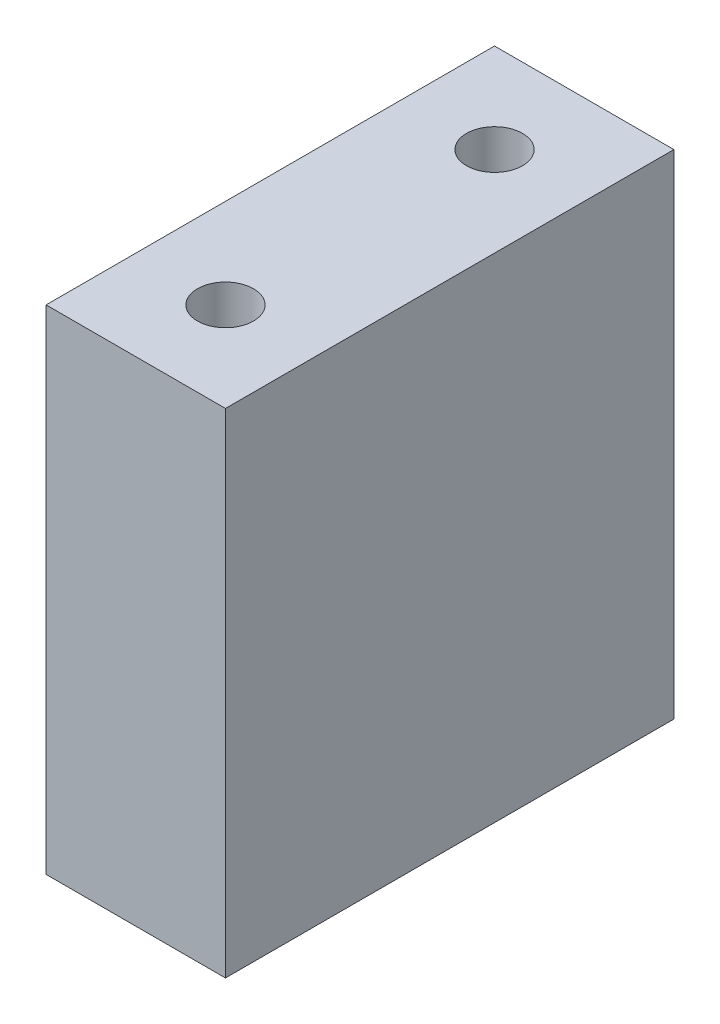
ISO-10303-21;
HEADER;
FILE_DESCRIPTION(('STEP AP214'),'2;1');
FILE_NAME('part.step','',(''),(''),'','','');
FILE_SCHEMA(('AUTOMOTIVE_DESIGN { 1 0 10303 214 1 1 1 1 }'));
ENDSEC;
DATA;
#1=APPLICATION_CONTEXT('core data for automotive mechanical design processes');
#2=APPLICATION_PROTOCOL_DEFINITION('international standard','automotive_design',2000,#1);
#3=PRODUCT_CONTEXT('',#1,'mechanical');
#4=PRODUCT('Part','Part','',(#3));
#5=PRODUCT_RELATED_PRODUCT_CATEGORY('part','',(#4));
#6=PRODUCT_DEFINITION_FORMATION('','',#4);
#7=PRODUCT_DEFINITION_CONTEXT('part definition',#1,'design');
#8=PRODUCT_DEFINITION('design','',#6,#7);
#9=PRODUCT_DEFINITION_SHAPE('','',#8);
#10=(LENGTH_UNIT() NAMED_UNIT(*) SI_UNIT(.MILLI.,.METRE.));
#11=(NAMED_UNIT(*) PLANE_ANGLE_UNIT() SI_UNIT($,.RADIAN.));
#12=(NAMED_UNIT(*) SI_UNIT($,.STERADIAN.) SOLID_ANGLE_UNIT());
#13=UNCERTAINTY_MEASURE_WITH_UNIT(LENGTH_MEASURE(1.E-05),#10,'distance_accuracy_value','');
#14=(GEOMETRIC_REPRESENTATION_CONTEXT(3) GLOBAL_UNCERTAINTY_ASSIGNED_CONTEXT((#13)) GLOBAL_UNIT_ASSIGNED_CONTEXT((#10,
#11,#12)) REPRESENTATION_CONTEXT('',''));
#15=CARTESIAN_POINT('',(0.,0.,0.));
#16=DIRECTION('',(0.,0.,1.));
#17=DIRECTION('',(1.,0.,0.));
#18=AXIS2_PLACEMENT_3D('',#15,#16,#17);
#19=CARTESIAN_POINT('',(4.,11.,-10.));
#20=DIRECTION('',(0.,0.,1.));
#21=DIRECTION('',(0.,-1.,0.));
#22=AXIS2_PLACEMENT_3D('',#19,#20,#21);
#23=PLANE('',#22);
#24=DIRECTION('',(0.,1.,0.));
#25=VECTOR('',#24,1.);
#26=CARTESIAN_POINT('',(-4.,11.,-10.));
#27=LINE('',#26,#25);
#28=CARTESIAN_POINT('',(-4.,-11.,-10.));
#29=VERTEX_POINT('',#28);
#30=CARTESIAN_POINT('',(-4.,11.,-10.));
#31=VERTEX_POINT('',#30);
#32=EDGE_CURVE('E131',#29,#31,#27,.T.);
#33=ORIENTED_EDGE('',*,*,#32,.T.);
#34=DIRECTION('',(-1.,0.,0.));
#35=VECTOR('',#34,1.);
#36=CARTESIAN_POINT('',(4.,11.,-10.));
#37=LINE('',#36,#35);
#38=CARTESIAN_POINT('',(4.,11.,-10.));
#39=VERTEX_POINT('',#38);
#40=EDGE_CURVE('E11',#39,#31,#37,.T.);
#41=ORIENTED_EDGE('',*,*,#40,.F.);
#42=DIRECTION('',(0.,1.,0.));
#43=VECTOR('',#42,1.);
#44=CARTESIAN_POINT('',(4.,11.,-10.));
#45=LINE('',#44,#43);
#46=CARTESIAN_POINT('',(4.,-11.,-10.));
#47=VERTEX_POINT('',#46);
#48=EDGE_CURVE('E132',#47,#39,#45,.T.);
#49=ORIENTED_EDGE('',*,*,#48,.F.);
#50=DIRECTION('',(-1.,0.,0.));
#51=VECTOR('',#50,1.);
#52=CARTESIAN_POINT('',(4.,-11.,-10.));
#53=LINE('',#52,#51);
#54=EDGE_CURVE('E138',#47,#29,#53,.T.);
#55=ORIENTED_EDGE('',*,*,#54,.T.);
#56=EDGE_LOOP('',(#33,#41,#49,#55));
#57=FACE_BOUND('',#56,.T.);
#58=ADVANCED_FACE('F38',(#57),#23,.F.);
#59=CARTESIAN_POINT('',(4.,11.,10.));
#60=DIRECTION('',(0.,-1.,0.));
#61=DIRECTION('',(0.,0.,-1.));
#62=AXIS2_PLACEMENT_3D('',#59,#60,#61);
#63=PLANE('',#62);
#64=CARTESIAN_POINT('',(0.,11.,-5.99999999999999));
#65=DIRECTION('',(0.,1.,0.));
#66=DIRECTION('',(0.,0.,1.));
#67=AXIS2_PLACEMENT_3D('',#64,#65,#66);
#68=CIRCLE('',#67,1.24999999999999);
#69=CARTESIAN_POINT('',(0.,11.,-4.75000000000001));
#70=VERTEX_POINT('',#69);
#71=EDGE_CURVE('E119',#70,#70,#68,.T.);
#72=ORIENTED_EDGE('',*,*,#71,.F.);
#73=EDGE_LOOP('',(#72));
#74=FACE_BOUND('',#73,.T.);
#75=CARTESIAN_POINT('',(0.,11.,6.));
#76=DIRECTION('',(0.,1.,0.));
#77=DIRECTION('',(0.,0.,1.));
#78=AXIS2_PLACEMENT_3D('',#75,#76,#77);
#79=CIRCLE('',#78,1.24999999999999);
#80=CARTESIAN_POINT('',(0.,11.,7.24999999999999));
#81=VERTEX_POINT('',#80);
#82=EDGE_CURVE('E125',#81,#81,#79,.T.);
#83=ORIENTED_EDGE('',*,*,#82,.F.);
#84=EDGE_LOOP('',(#83));
#85=FACE_BOUND('',#84,.T.);
#86=DIRECTION('',(0.,0.,1.));
#87=VECTOR('',#86,1.);
#88=CARTESIAN_POINT('',(-4.,11.,10.));
#89=LINE('',#88,#87);
#90=CARTESIAN_POINT('',(-4.,11.,10.));
#91=VERTEX_POINT('',#90);
#92=EDGE_CURVE('E141',#31,#91,#89,.T.);
#93=ORIENTED_EDGE('',*,*,#92,.T.);
#94=DIRECTION('',(-1.,0.,0.));
#95=VECTOR('',#94,1.);
#96=CARTESIAN_POINT('',(4.,11.,10.));
#97=LINE('',#96,#95);
#98=CARTESIAN_POINT('',(4.,11.,10.));
#99=VERTEX_POINT('',#98);
#100=EDGE_CURVE('E46',#99,#91,#97,.T.);
#101=ORIENTED_EDGE('',*,*,#100,.F.);
#102=DIRECTION('',(0.,0.,1.));
#103=VECTOR('',#102,1.);
#104=CARTESIAN_POINT('',(4.,11.,10.));
#105=LINE('',#104,#103);
#106=EDGE_CURVE('E85',#39,#99,#105,.T.);
#107=ORIENTED_EDGE('',*,*,#106,.F.);
#108=ORIENTED_EDGE('',*,*,#40,.T.);
#109=EDGE_LOOP('',(#93,#101,#107,#108));
#110=FACE_BOUND('',#109,.T.);
#111=ADVANCED_FACE('F165',(#74,#85,#110),#63,.F.);
#112=CARTESIAN_POINT('',(4.,11.,10.));
#113=DIRECTION('',(0.,0.,-1.));
#114=DIRECTION('',(0.,1.,0.));
#115=AXIS2_PLACEMENT_3D('',#112,#113,#114);
#116=PLANE('',#115);
#117=DIRECTION('',(0.,-1.,0.));
#118=VECTOR('',#117,1.);
#119=CARTESIAN_POINT('',(-4.,11.,10.));
#120=LINE('',#119,#118);
#121=CARTESIAN_POINT('',(-4.,-11.,10.));
#122=VERTEX_POINT('',#121);
#123=EDGE_CURVE('E72',#91,#122,#120,.T.);
#124=ORIENTED_EDGE('',*,*,#123,.T.);
#125=DIRECTION('',(-1.,0.,0.));
#126=VECTOR('',#125,1.);
#127=CARTESIAN_POINT('',(4.,-11.,10.));
#128=LINE('',#127,#126);
#129=CARTESIAN_POINT('',(4.,-11.,10.));
#130=VERTEX_POINT('',#129);
#131=EDGE_CURVE('E146',#130,#122,#128,.T.);
#132=ORIENTED_EDGE('',*,*,#131,.F.);
#133=DIRECTION('',(0.,-1.,0.));
#134=VECTOR('',#133,1.);
#135=CARTESIAN_POINT('',(4.,11.,10.));
#136=LINE('',#135,#134);
#137=EDGE_CURVE('E135',#99,#130,#136,.T.);
#138=ORIENTED_EDGE('',*,*,#137,.F.);
#139=ORIENTED_EDGE('',*,*,#100,.T.);
#140=EDGE_LOOP('',(#124,#132,#138,#139));
#141=FACE_BOUND('',#140,.T.);
#142=ADVANCED_FACE('F148',(#141),#116,.F.);
#143=CARTESIAN_POINT('',(4.,-11.,10.));
#144=DIRECTION('',(0.,1.,0.));
#145=DIRECTION('',(0.,0.,1.));
#146=AXIS2_PLACEMENT_3D('',#143,#144,#145);
#147=PLANE('',#146);
#148=CARTESIAN_POINT('',(0.,-11.,5.99999999999999));
#149=DIRECTION('',(0.,-1.,0.));
#150=DIRECTION('',(0.,0.,-1.));
#151=AXIS2_PLACEMENT_3D('',#148,#149,#150);
#152=CIRCLE('',#151,1.25);
#153=CARTESIAN_POINT('',(0.,-11.,4.74999999999999));
#154=VERTEX_POINT('',#153);
#155=EDGE_CURVE('E109',#154,#154,#152,.T.);
#156=ORIENTED_EDGE('',*,*,#155,.F.);
#157=EDGE_LOOP('',(#156));
#158=FACE_BOUND('',#157,.T.);
#159=CARTESIAN_POINT('',(0.,-11.,-6.00000000000001));
#160=DIRECTION('',(0.,-1.,0.));
#161=DIRECTION('',(0.,0.,-1.));
#162=AXIS2_PLACEMENT_3D('',#159,#160,#161);
#163=CIRCLE('',#162,1.25);
#164=CARTESIAN_POINT('',(0.,-11.,-7.25));
#165=VERTEX_POINT('',#164);
#166=EDGE_CURVE('E108',#165,#165,#163,.T.);
#167=ORIENTED_EDGE('',*,*,#166,.F.);
#168=EDGE_LOOP('',(#167));
#169=FACE_BOUND('',#168,.T.);
#170=DIRECTION('',(0.,0.,-1.));
#171=VECTOR('',#170,1.);
#172=CARTESIAN_POINT('',(-4.,-11.,10.));
#173=LINE('',#172,#171);
#174=EDGE_CURVE('E78',#122,#29,#173,.T.);
#175=ORIENTED_EDGE('',*,*,#174,.T.);
#176=ORIENTED_EDGE('',*,*,#54,.F.);
#177=DIRECTION('',(0.,0.,-1.));
#178=VECTOR('',#177,1.);
#179=CARTESIAN_POINT('',(4.,-11.,10.));
#180=LINE('',#179,#178);
#181=EDGE_CURVE('E54',#130,#47,#180,.T.);
#182=ORIENTED_EDGE('',*,*,#181,.F.);
#183=ORIENTED_EDGE('',*,*,#131,.T.);
#184=EDGE_LOOP('',(#175,#176,#182,#183));
#185=FACE_BOUND('',#184,.T.);
#186=ADVANCED_FACE('F155',(#158,#169,#185),#147,.F.);
#187=CARTESIAN_POINT('',(4.,0.,0.));
#188=DIRECTION('',(1.,0.,0.));
#189=DIRECTION('',(0.,0.,-1.));
#190=AXIS2_PLACEMENT_3D('',#187,#188,#189);
#191=PLANE('',#190);
#192=ORIENTED_EDGE('',*,*,#48,.T.);
#193=ORIENTED_EDGE('',*,*,#106,.T.);
#194=ORIENTED_EDGE('',*,*,#137,.T.);
#195=ORIENTED_EDGE('',*,*,#181,.T.);
#196=EDGE_LOOP('',(#192,#193,#194,#195));
#197=FACE_BOUND('',#196,.T.);
#198=ADVANCED_FACE('F157',(#197),#191,.T.);
#199=CARTESIAN_POINT('',(-4.,0.,0.));
#200=DIRECTION('',(1.,0.,0.));
#201=DIRECTION('',(0.,0.,-1.));
#202=AXIS2_PLACEMENT_3D('',#199,#200,#201);
#203=PLANE('',#202);
#204=ORIENTED_EDGE('',*,*,#32,.F.);
#205=ORIENTED_EDGE('',*,*,#174,.F.);
#206=ORIENTED_EDGE('',*,*,#123,.F.);
#207=ORIENTED_EDGE('',*,*,#92,.F.);
#208=EDGE_LOOP('',(#204,#205,#206,#207));
#209=FACE_BOUND('',#208,.T.);
#210=ADVANCED_FACE('F151',(#209),#203,.F.);
#211=CARTESIAN_POINT('',(0.,3.49999999999999,6.));
#212=DIRECTION('',(0.,1.,0.));
#213=DIRECTION('',(0.,0.,1.));
#214=AXIS2_PLACEMENT_3D('',#211,#212,#213);
#215=CONICAL_SURFACE('',#214,1.24999999999999,1.02974425867665);
#216=CARTESIAN_POINT('',(0.,2.74892422621555,6.));
#217=VERTEX_POINT('',#216);
#218=VERTEX_LOOP('',#217);
#219=FACE_BOUND('',#218,.T.);
#220=CARTESIAN_POINT('',(0.,3.49999999999999,6.));
#221=DIRECTION('',(0.,1.,0.));
#222=DIRECTION('',(0.,0.,1.));
#223=AXIS2_PLACEMENT_3D('',#220,#221,#222);
#224=CIRCLE('',#223,1.24999999999999);
#225=CARTESIAN_POINT('',(0.,3.49999999999999,7.24999999999999));
#226=VERTEX_POINT('',#225);
#227=EDGE_CURVE('E128',#226,#226,#224,.T.);
#228=ORIENTED_EDGE('',*,*,#227,.T.);
#229=EDGE_LOOP('',(#228));
#230=FACE_BOUND('',#229,.T.);
#231=ADVANCED_FACE('F184',(#219,#230),#215,.F.);
#232=CARTESIAN_POINT('',(0.,11.,6.));
#233=DIRECTION('',(0.,1.,0.));
#234=DIRECTION('',(0.,0.,1.));
#235=AXIS2_PLACEMENT_3D('',#232,#233,#234);
#236=CYLINDRICAL_SURFACE('',#235,1.24999999999999);
#237=ORIENTED_EDGE('',*,*,#227,.F.);
#238=EDGE_LOOP('',(#237));
#239=FACE_BOUND('',#238,.T.);
#240=ORIENTED_EDGE('',*,*,#82,.T.);
#241=EDGE_LOOP('',(#240));
#242=FACE_BOUND('',#241,.T.);
#243=ADVANCED_FACE('F181',(#239,#242),#236,.F.);
#244=CARTESIAN_POINT('',(0.,3.49999999999999,-5.99999999999999));
#245=DIRECTION('',(0.,1.,0.));
#246=DIRECTION('',(0.,0.,1.));
#247=AXIS2_PLACEMENT_3D('',#244,#245,#246);
#248=CONICAL_SURFACE('',#247,1.24999999999999,1.02974425867665);
#249=CARTESIAN_POINT('',(0.,2.74892422621555,-5.99999999999999));
#250=VERTEX_POINT('',#249);
#251=VERTEX_LOOP('',#250);
#252=FACE_BOUND('',#251,.T.);
#253=CARTESIAN_POINT('',(0.,3.49999999999999,-5.99999999999999));
#254=DIRECTION('',(0.,1.,0.));
#255=DIRECTION('',(0.,0.,1.));
#256=AXIS2_PLACEMENT_3D('',#253,#254,#255);
#257=CIRCLE('',#256,1.24999999999999);
#258=CARTESIAN_POINT('',(0.,3.49999999999999,-4.75000000000001));
#259=VERTEX_POINT('',#258);
#260=EDGE_CURVE('E122',#259,#259,#257,.T.);
#261=ORIENTED_EDGE('',*,*,#260,.T.);
#262=EDGE_LOOP('',(#261));
#263=FACE_BOUND('',#262,.T.);
#264=ADVANCED_FACE('F183',(#252,#263),#248,.F.);
#265=CARTESIAN_POINT('',(0.,11.,-5.99999999999999));
#266=DIRECTION('',(0.,1.,0.));
#267=DIRECTION('',(0.,0.,1.));
#268=AXIS2_PLACEMENT_3D('',#265,#266,#267);
#269=CYLINDRICAL_SURFACE('',#268,1.24999999999999);
#270=ORIENTED_EDGE('',*,*,#260,.F.);
#271=EDGE_LOOP('',(#270));
#272=FACE_BOUND('',#271,.T.);
#273=ORIENTED_EDGE('',*,*,#71,.T.);
#274=EDGE_LOOP('',(#273));
#275=FACE_BOUND('',#274,.T.);
#276=ADVANCED_FACE('F191',(#272,#275),#269,.F.);
#277=CARTESIAN_POINT('',(0.,-3.5,-6.00000000000001));
#278=DIRECTION('',(0.,-1.,0.));
#279=DIRECTION('',(0.,0.,-1.));
#280=AXIS2_PLACEMENT_3D('',#277,#278,#279);
#281=CONICAL_SURFACE('',#280,1.25,1.02974425867665);
#282=CARTESIAN_POINT('',(0.,-2.74892422621555,-6.00000000000001));
#283=VERTEX_POINT('',#282);
#284=VERTEX_LOOP('',#283);
#285=FACE_BOUND('',#284,.T.);
#286=CARTESIAN_POINT('',(0.,-3.5,-6.00000000000001));
#287=DIRECTION('',(0.,-1.,0.));
#288=DIRECTION('',(0.,0.,-1.));
#289=AXIS2_PLACEMENT_3D('',#286,#287,#288);
#290=CIRCLE('',#289,1.25);
#291=CARTESIAN_POINT('',(0.,-3.5,-7.25));
#292=VERTEX_POINT('',#291);
#293=EDGE_CURVE('E112',#292,#292,#290,.T.);
#294=ORIENTED_EDGE('',*,*,#293,.T.);
#295=EDGE_LOOP('',(#294));
#296=FACE_BOUND('',#295,.T.);
#297=ADVANCED_FACE('F235',(#285,#296),#281,.F.);
#298=CARTESIAN_POINT('',(0.,-11.,-6.00000000000001));
#299=DIRECTION('',(0.,-1.,0.));
#300=DIRECTION('',(0.,0.,-1.));
#301=AXIS2_PLACEMENT_3D('',#298,#299,#300);
#302=CYLINDRICAL_SURFACE('',#301,1.25);
#303=ORIENTED_EDGE('',*,*,#293,.F.);
#304=EDGE_LOOP('',(#303));
#305=FACE_BOUND('',#304,.T.);
#306=ORIENTED_EDGE('',*,*,#166,.T.);
#307=EDGE_LOOP('',(#306));
#308=FACE_BOUND('',#307,.T.);
#309=ADVANCED_FACE('F102',(#305,#308),#302,.F.);
#310=CARTESIAN_POINT('',(0.,-3.5,5.99999999999999));
#311=DIRECTION('',(0.,-1.,0.));
#312=DIRECTION('',(0.,0.,-1.));
#313=AXIS2_PLACEMENT_3D('',#310,#311,#312);
#314=CONICAL_SURFACE('',#313,1.25,1.02974425867665);
#315=CARTESIAN_POINT('',(0.,-2.74892422621555,5.99999999999999));
#316=VERTEX_POINT('',#315);
#317=VERTEX_LOOP('',#316);
#318=FACE_BOUND('',#317,.T.);
#319=CARTESIAN_POINT('',(0.,-3.5,5.99999999999999));
#320=DIRECTION('',(0.,-1.,0.));
#321=DIRECTION('',(0.,0.,-1.));
#322=AXIS2_PLACEMENT_3D('',#319,#320,#321);
#323=CIRCLE('',#322,1.25);
#324=CARTESIAN_POINT('',(0.,-3.5,4.75));
#325=VERTEX_POINT('',#324);
#326=EDGE_CURVE('E106',#325,#325,#323,.T.);
#327=ORIENTED_EDGE('',*,*,#326,.T.);
#328=EDGE_LOOP('',(#327));
#329=FACE_BOUND('',#328,.T.);
#330=ADVANCED_FACE('F98',(#318,#329),#314,.F.);
#331=CARTESIAN_POINT('',(0.,-11.,5.99999999999999));
#332=DIRECTION('',(0.,-1.,0.));
#333=DIRECTION('',(0.,0.,-1.));
#334=AXIS2_PLACEMENT_3D('',#331,#332,#333);
#335=CYLINDRICAL_SURFACE('',#334,1.25);
#336=ORIENTED_EDGE('',*,*,#326,.F.);
#337=EDGE_LOOP('',(#336));
#338=FACE_BOUND('',#337,.T.);
#339=ORIENTED_EDGE('',*,*,#155,.T.);
#340=EDGE_LOOP('',(#339));
#341=FACE_BOUND('',#340,.T.);
#342=ADVANCED_FACE('F101',(#338,#341),#335,.F.);
#343=CLOSED_SHELL('',(#58,#111,#142,#186,#198,#210,#231,#243,#264,#276,#297,#309,#330,#342));
#344=MANIFOLD_SOLID_BREP('B2',#343);
#345=ADVANCED_BREP_SHAPE_REPRESENTATION('',(#18,#344),#14);
#346=SHAPE_DEFINITION_REPRESENTATION(#9,#345);
ENDSEC;
END-ISO-10303-21;
